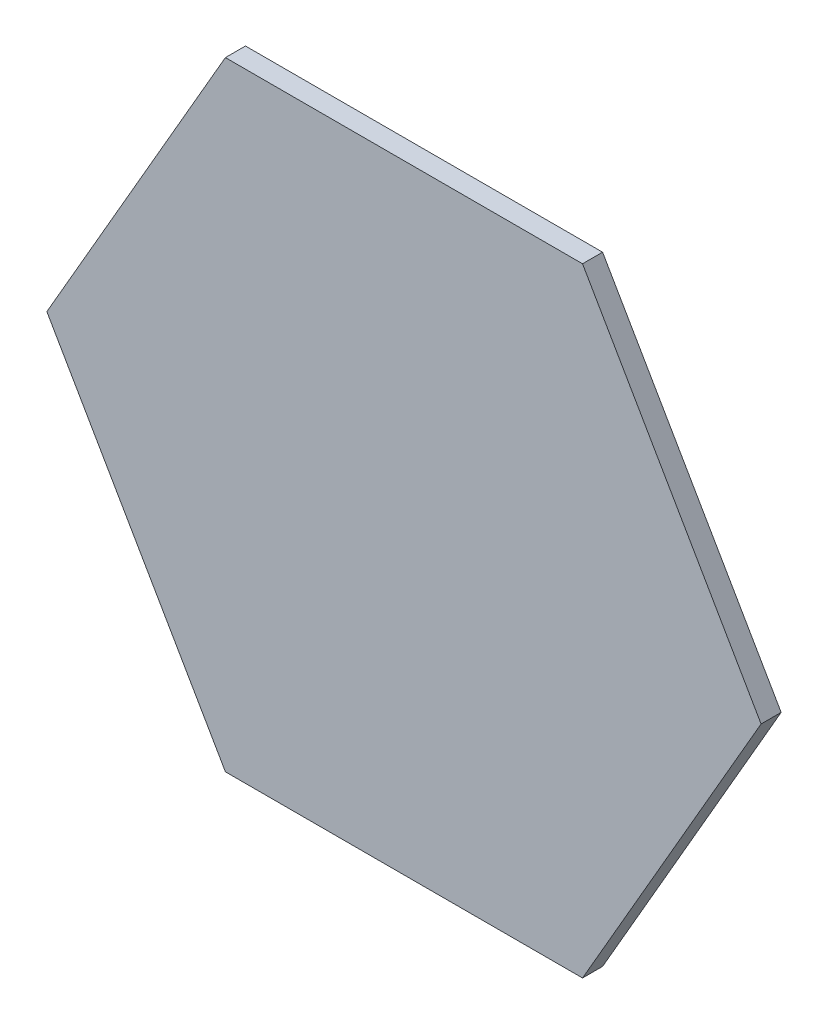
ISO-10303-21;
HEADER;
FILE_DESCRIPTION(('STEP AP214'),'2;1');
FILE_NAME('part.step','',(''),(''),'','','');
FILE_SCHEMA(('AUTOMOTIVE_DESIGN { 1 0 10303 214 1 1 1 1 }'));
ENDSEC;
DATA;
#1=APPLICATION_CONTEXT('core data for automotive mechanical design processes');
#2=APPLICATION_PROTOCOL_DEFINITION('international standard','automotive_design',2000,#1);
#3=PRODUCT_CONTEXT('',#1,'mechanical');
#4=PRODUCT('Part','Part','',(#3));
#5=PRODUCT_RELATED_PRODUCT_CATEGORY('part','',(#4));
#6=PRODUCT_DEFINITION_FORMATION('','',#4);
#7=PRODUCT_DEFINITION_CONTEXT('part definition',#1,'design');
#8=PRODUCT_DEFINITION('design','',#6,#7);
#9=PRODUCT_DEFINITION_SHAPE('','',#8);
#10=(LENGTH_UNIT() NAMED_UNIT(*) SI_UNIT(.MILLI.,.METRE.));
#11=(NAMED_UNIT(*) PLANE_ANGLE_UNIT() SI_UNIT($,.RADIAN.));
#12=(NAMED_UNIT(*) SI_UNIT($,.STERADIAN.) SOLID_ANGLE_UNIT());
#13=UNCERTAINTY_MEASURE_WITH_UNIT(LENGTH_MEASURE(1.E-05),#10,'distance_accuracy_value','');
#14=(GEOMETRIC_REPRESENTATION_CONTEXT(3) GLOBAL_UNCERTAINTY_ASSIGNED_CONTEXT((#13)) GLOBAL_UNIT_ASSIGNED_CONTEXT((#10,
#11,#12)) REPRESENTATION_CONTEXT('',''));
#15=CARTESIAN_POINT('',(0.,0.,0.));
#16=DIRECTION('',(0.,0.,1.));
#17=DIRECTION('',(1.,0.,0.));
#18=AXIS2_PLACEMENT_3D('',#15,#16,#17);
#19=CARTESIAN_POINT('',(22.606,-39.154740555902,2.54));
#20=DIRECTION('',(-0.866025403784439,0.5,0.));
#21=DIRECTION('',(-0.5,-0.866025403784439,0.));
#22=AXIS2_PLACEMENT_3D('',#19,#20,#21);
#23=PLANE('',#22);
#24=DIRECTION('',(0.5,0.866025403784439,0.));
#25=VECTOR('',#24,1.);
#26=CARTESIAN_POINT('',(22.606,-39.154740555902,0.));
#27=LINE('',#26,#25);
#28=CARTESIAN_POINT('',(22.606,-39.154740555902,0.));
#29=VERTEX_POINT('',#28);
#30=CARTESIAN_POINT('',(45.212,0.,0.));
#31=VERTEX_POINT('',#30);
#32=EDGE_CURVE('E128',#29,#31,#27,.T.);
#33=ORIENTED_EDGE('',*,*,#32,.T.);
#34=DIRECTION('',(0.,0.,-1.));
#35=VECTOR('',#34,1.);
#36=CARTESIAN_POINT('',(45.212,0.,2.54));
#37=LINE('',#36,#35);
#38=CARTESIAN_POINT('',(45.212,0.,2.54));
#39=VERTEX_POINT('',#38);
#40=EDGE_CURVE('E11',#39,#31,#37,.T.);
#41=ORIENTED_EDGE('',*,*,#40,.F.);
#42=DIRECTION('',(0.5,0.866025403784439,0.));
#43=VECTOR('',#42,1.);
#44=CARTESIAN_POINT('',(22.606,-39.154740555902,2.54));
#45=LINE('',#44,#43);
#46=CARTESIAN_POINT('',(22.606,-39.154740555902,2.54));
#47=VERTEX_POINT('',#46);
#48=EDGE_CURVE('E144',#47,#39,#45,.T.);
#49=ORIENTED_EDGE('',*,*,#48,.F.);
#50=DIRECTION('',(0.,0.,-1.));
#51=VECTOR('',#50,1.);
#52=CARTESIAN_POINT('',(22.606,-39.154740555902,2.54));
#53=LINE('',#52,#51);
#54=EDGE_CURVE('E124',#47,#29,#53,.T.);
#55=ORIENTED_EDGE('',*,*,#54,.T.);
#56=EDGE_LOOP('',(#33,#41,#49,#55));
#57=FACE_BOUND('',#56,.T.);
#58=ADVANCED_FACE('F39',(#57),#23,.F.);
#59=CARTESIAN_POINT('',(45.212,0.,2.54));
#60=DIRECTION('',(-0.866025403784439,-0.5,0.));
#61=DIRECTION('',(0.5,-0.866025403784439,0.));
#62=AXIS2_PLACEMENT_3D('',#59,#60,#61);
#63=PLANE('',#62);
#64=DIRECTION('',(-0.5,0.866025403784439,0.));
#65=VECTOR('',#64,1.);
#66=CARTESIAN_POINT('',(45.212,0.,0.));
#67=LINE('',#66,#65);
#68=CARTESIAN_POINT('',(22.606,39.1547405559021,0.));
#69=VERTEX_POINT('',#68);
#70=EDGE_CURVE('E132',#31,#69,#67,.T.);
#71=ORIENTED_EDGE('',*,*,#70,.T.);
#72=DIRECTION('',(0.,0.,-1.));
#73=VECTOR('',#72,1.);
#74=CARTESIAN_POINT('',(22.606,39.1547405559021,2.54));
#75=LINE('',#74,#73);
#76=CARTESIAN_POINT('',(22.606,39.1547405559021,2.54));
#77=VERTEX_POINT('',#76);
#78=EDGE_CURVE('E48',#77,#69,#75,.T.);
#79=ORIENTED_EDGE('',*,*,#78,.F.);
#80=DIRECTION('',(-0.5,0.866025403784439,0.));
#81=VECTOR('',#80,1.);
#82=CARTESIAN_POINT('',(45.212,0.,2.54));
#83=LINE('',#82,#81);
#84=EDGE_CURVE('E93',#39,#77,#83,.T.);
#85=ORIENTED_EDGE('',*,*,#84,.F.);
#86=ORIENTED_EDGE('',*,*,#40,.T.);
#87=EDGE_LOOP('',(#71,#79,#85,#86));
#88=FACE_BOUND('',#87,.T.);
#89=ADVANCED_FACE('F172',(#88),#63,.F.);
#90=CARTESIAN_POINT('',(22.606,39.1547405559021,2.54));
#91=DIRECTION('',(0.,-1.,0.));
#92=DIRECTION('',(0.,0.,-1.));
#93=AXIS2_PLACEMENT_3D('',#90,#91,#92);
#94=PLANE('',#93);
#95=DIRECTION('',(-1.,0.,0.));
#96=VECTOR('',#95,1.);
#97=CARTESIAN_POINT('',(22.606,39.1547405559021,0.));
#98=LINE('',#97,#96);
#99=CARTESIAN_POINT('',(-22.606,39.1547405559021,0.));
#100=VERTEX_POINT('',#99);
#101=EDGE_CURVE('E135',#69,#100,#98,.T.);
#102=ORIENTED_EDGE('',*,*,#101,.T.);
#103=DIRECTION('',(0.,0.,-1.));
#104=VECTOR('',#103,1.);
#105=CARTESIAN_POINT('',(-22.606,39.1547405559021,2.54));
#106=LINE('',#105,#104);
#107=CARTESIAN_POINT('',(-22.606,39.1547405559021,2.54));
#108=VERTEX_POINT('',#107);
#109=EDGE_CURVE('E117',#108,#100,#106,.T.);
#110=ORIENTED_EDGE('',*,*,#109,.F.);
#111=DIRECTION('',(-1.,0.,0.));
#112=VECTOR('',#111,1.);
#113=CARTESIAN_POINT('',(22.606,39.1547405559021,2.54));
#114=LINE('',#113,#112);
#115=EDGE_CURVE('E106',#77,#108,#114,.T.);
#116=ORIENTED_EDGE('',*,*,#115,.F.);
#117=ORIENTED_EDGE('',*,*,#78,.T.);
#118=EDGE_LOOP('',(#102,#110,#116,#117));
#119=FACE_BOUND('',#118,.T.);
#120=ADVANCED_FACE('F154',(#119),#94,.F.);
#121=CARTESIAN_POINT('',(-22.606,39.1547405559021,2.54));
#122=DIRECTION('',(0.866025403784438,-0.5,0.));
#123=DIRECTION('',(0.5,0.866025403784439,0.));
#124=AXIS2_PLACEMENT_3D('',#121,#122,#123);
#125=PLANE('',#124);
#126=DIRECTION('',(-0.5,-0.866025403784438,0.));
#127=VECTOR('',#126,1.);
#128=CARTESIAN_POINT('',(-22.606,39.1547405559021,0.));
#129=LINE('',#128,#127);
#130=CARTESIAN_POINT('',(-45.212,0.,0.));
#131=VERTEX_POINT('',#130);
#132=EDGE_CURVE('E115',#100,#131,#129,.T.);
#133=ORIENTED_EDGE('',*,*,#132,.T.);
#134=DIRECTION('',(0.,0.,-1.));
#135=VECTOR('',#134,1.);
#136=CARTESIAN_POINT('',(-45.212,0.,2.54));
#137=LINE('',#136,#135);
#138=CARTESIAN_POINT('',(-45.212,0.,2.54));
#139=VERTEX_POINT('',#138);
#140=EDGE_CURVE('E112',#139,#131,#137,.T.);
#141=ORIENTED_EDGE('',*,*,#140,.F.);
#142=DIRECTION('',(-0.5,-0.866025403784438,0.));
#143=VECTOR('',#142,1.);
#144=CARTESIAN_POINT('',(-22.606,39.1547405559021,2.54));
#145=LINE('',#144,#143);
#146=EDGE_CURVE('E100',#108,#139,#145,.T.);
#147=ORIENTED_EDGE('',*,*,#146,.F.);
#148=ORIENTED_EDGE('',*,*,#109,.T.);
#149=EDGE_LOOP('',(#133,#141,#147,#148));
#150=FACE_BOUND('',#149,.T.);
#151=ADVANCED_FACE('F113',(#150),#125,.F.);
#152=CARTESIAN_POINT('',(-45.212,0.,2.54));
#153=DIRECTION('',(0.866025403784439,0.5,0.));
#154=DIRECTION('',(-0.5,0.866025403784439,0.));
#155=AXIS2_PLACEMENT_3D('',#152,#153,#154);
#156=PLANE('',#155);
#157=DIRECTION('',(0.5,-0.866025403784439,0.));
#158=VECTOR('',#157,1.);
#159=CARTESIAN_POINT('',(-45.212,0.,0.));
#160=LINE('',#159,#158);
#161=CARTESIAN_POINT('',(-22.606,-39.154740555902,0.));
#162=VERTEX_POINT('',#161);
#163=EDGE_CURVE('E79',#131,#162,#160,.T.);
#164=ORIENTED_EDGE('',*,*,#163,.T.);
#165=DIRECTION('',(0.,0.,-1.));
#166=VECTOR('',#165,1.);
#167=CARTESIAN_POINT('',(-22.606,-39.154740555902,2.54));
#168=LINE('',#167,#166);
#169=CARTESIAN_POINT('',(-22.606,-39.154740555902,2.54));
#170=VERTEX_POINT('',#169);
#171=EDGE_CURVE('E118',#170,#162,#168,.T.);
#172=ORIENTED_EDGE('',*,*,#171,.F.);
#173=DIRECTION('',(0.5,-0.866025403784439,0.));
#174=VECTOR('',#173,1.);
#175=CARTESIAN_POINT('',(-45.212,0.,2.54));
#176=LINE('',#175,#174);
#177=EDGE_CURVE('E104',#139,#170,#176,.T.);
#178=ORIENTED_EDGE('',*,*,#177,.F.);
#179=ORIENTED_EDGE('',*,*,#140,.T.);
#180=EDGE_LOOP('',(#164,#172,#178,#179));
#181=FACE_BOUND('',#180,.T.);
#182=ADVANCED_FACE('F120',(#181),#156,.F.);
#183=CARTESIAN_POINT('',(-22.606,-39.154740555902,2.54));
#184=DIRECTION('',(0.,1.,0.));
#185=DIRECTION('',(-1.,0.,0.));
#186=AXIS2_PLACEMENT_3D('',#183,#184,#185);
#187=PLANE('',#186);
#188=DIRECTION('',(1.,0.,0.));
#189=VECTOR('',#188,1.);
#190=CARTESIAN_POINT('',(-22.606,-39.154740555902,0.));
#191=LINE('',#190,#189);
#192=EDGE_CURVE('E85',#162,#29,#191,.T.);
#193=ORIENTED_EDGE('',*,*,#192,.T.);
#194=ORIENTED_EDGE('',*,*,#54,.F.);
#195=DIRECTION('',(1.,0.,0.));
#196=VECTOR('',#195,1.);
#197=CARTESIAN_POINT('',(-22.606,-39.154740555902,2.54));
#198=LINE('',#197,#196);
#199=EDGE_CURVE('E56',#170,#47,#198,.T.);
#200=ORIENTED_EDGE('',*,*,#199,.F.);
#201=ORIENTED_EDGE('',*,*,#171,.T.);
#202=EDGE_LOOP('',(#193,#194,#200,#201));
#203=FACE_BOUND('',#202,.T.);
#204=ADVANCED_FACE('F161',(#203),#187,.F.);
#205=CARTESIAN_POINT('',(0.,0.,2.54));
#206=DIRECTION('',(0.,0.,1.));
#207=DIRECTION('',(1.,0.,0.));
#208=AXIS2_PLACEMENT_3D('',#205,#206,#207);
#209=PLANE('',#208);
#210=ORIENTED_EDGE('',*,*,#48,.T.);
#211=ORIENTED_EDGE('',*,*,#84,.T.);
#212=ORIENTED_EDGE('',*,*,#115,.T.);
#213=ORIENTED_EDGE('',*,*,#146,.T.);
#214=ORIENTED_EDGE('',*,*,#177,.T.);
#215=ORIENTED_EDGE('',*,*,#199,.T.);
#216=EDGE_LOOP('',(#210,#211,#212,#213,#214,#215));
#217=FACE_BOUND('',#216,.T.);
#218=ADVANCED_FACE('F102',(#217),#209,.T.);
#219=CARTESIAN_POINT('',(0.,0.,0.));
#220=DIRECTION('',(0.,0.,1.));
#221=DIRECTION('',(1.,0.,0.));
#222=AXIS2_PLACEMENT_3D('',#219,#220,#221);
#223=PLANE('',#222);
#224=ORIENTED_EDGE('',*,*,#32,.F.);
#225=ORIENTED_EDGE('',*,*,#192,.F.);
#226=ORIENTED_EDGE('',*,*,#163,.F.);
#227=ORIENTED_EDGE('',*,*,#132,.F.);
#228=ORIENTED_EDGE('',*,*,#101,.F.);
#229=ORIENTED_EDGE('',*,*,#70,.F.);
#230=EDGE_LOOP('',(#224,#225,#226,#227,#228,#229));
#231=FACE_BOUND('',#230,.T.);
#232=ADVANCED_FACE('F157',(#231),#223,.F.);
#233=CLOSED_SHELL('',(#58,#89,#120,#151,#182,#204,#218,#232));
#234=MANIFOLD_SOLID_BREP('B2',#233);
#235=ADVANCED_BREP_SHAPE_REPRESENTATION('',(#18,#234),#14);
#236=SHAPE_DEFINITION_REPRESENTATION(#9,#235);
ENDSEC;
END-ISO-10303-21;
